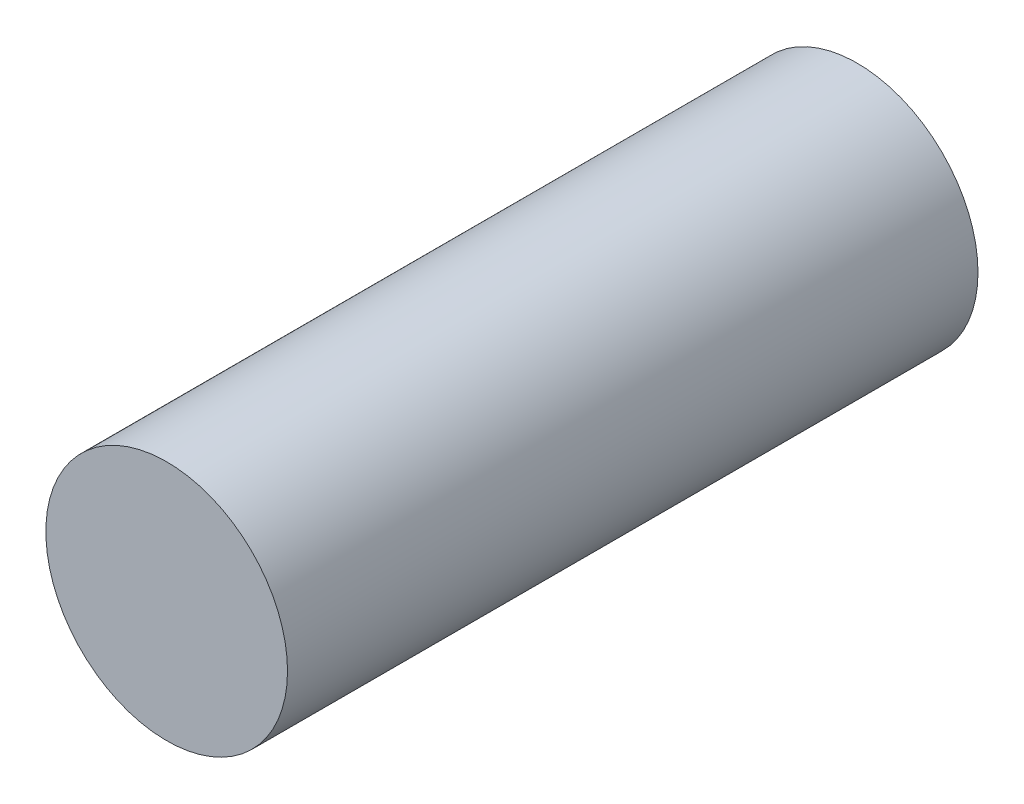
ISO-10303-21;
HEADER;
FILE_DESCRIPTION(('STEP AP214'),'2;1');
FILE_NAME('part.step','',(''),(''),'','','');
FILE_SCHEMA(('AUTOMOTIVE_DESIGN { 1 0 10303 214 1 1 1 1 }'));
ENDSEC;
DATA;
#1=APPLICATION_CONTEXT('core data for automotive mechanical design processes');
#2=APPLICATION_PROTOCOL_DEFINITION('international standard','automotive_design',2000,#1);
#3=PRODUCT_CONTEXT('',#1,'mechanical');
#4=PRODUCT('Part','Part','',(#3));
#5=PRODUCT_RELATED_PRODUCT_CATEGORY('part','',(#4));
#6=PRODUCT_DEFINITION_FORMATION('','',#4);
#7=PRODUCT_DEFINITION_CONTEXT('part definition',#1,'design');
#8=PRODUCT_DEFINITION('design','',#6,#7);
#9=PRODUCT_DEFINITION_SHAPE('','',#8);
#10=(LENGTH_UNIT() NAMED_UNIT(*) SI_UNIT(.MILLI.,.METRE.));
#11=(NAMED_UNIT(*) PLANE_ANGLE_UNIT() SI_UNIT($,.RADIAN.));
#12=(NAMED_UNIT(*) SI_UNIT($,.STERADIAN.) SOLID_ANGLE_UNIT());
#13=UNCERTAINTY_MEASURE_WITH_UNIT(LENGTH_MEASURE(1.E-05),#10,'distance_accuracy_value','');
#14=(GEOMETRIC_REPRESENTATION_CONTEXT(3) GLOBAL_UNCERTAINTY_ASSIGNED_CONTEXT((#13)) GLOBAL_UNIT_ASSIGNED_CONTEXT((#10,
#11,#12)) REPRESENTATION_CONTEXT('',''));
#15=CARTESIAN_POINT('',(0.,0.,0.));
#16=DIRECTION('',(0.,0.,1.));
#17=DIRECTION('',(1.,0.,0.));
#18=AXIS2_PLACEMENT_3D('',#15,#16,#17);
#19=CARTESIAN_POINT('',(0.,0.,100.));
#20=DIRECTION('',(0.,0.,-1.));
#21=DIRECTION('',(-1.,0.,0.));
#22=AXIS2_PLACEMENT_3D('',#19,#20,#21);
#23=CYLINDRICAL_SURFACE('',#22,17.5);
#24=CARTESIAN_POINT('',(0.,0.,100.));
#25=DIRECTION('',(0.,0.,1.));
#26=DIRECTION('',(1.,0.,0.));
#27=AXIS2_PLACEMENT_3D('',#24,#25,#26);
#28=CIRCLE('',#27,17.5);
#29=CARTESIAN_POINT('',(17.5,0.,100.));
#30=VERTEX_POINT('',#29);
#31=EDGE_CURVE('E10',#30,#30,#28,.T.);
#32=ORIENTED_EDGE('',*,*,#31,.F.);
#33=EDGE_LOOP('',(#32));
#34=FACE_BOUND('',#33,.T.);
#35=CARTESIAN_POINT('',(0.,0.,0.));
#36=DIRECTION('',(0.,0.,1.));
#37=DIRECTION('',(1.,0.,0.));
#38=AXIS2_PLACEMENT_3D('',#35,#36,#37);
#39=CIRCLE('',#38,17.5);
#40=CARTESIAN_POINT('',(17.5,0.,0.));
#41=VERTEX_POINT('',#40);
#42=EDGE_CURVE('E34',#41,#41,#39,.T.);
#43=ORIENTED_EDGE('',*,*,#42,.T.);
#44=EDGE_LOOP('',(#43));
#45=FACE_BOUND('',#44,.T.);
#46=ADVANCED_FACE('F31',(#34,#45),#23,.T.);
#47=CARTESIAN_POINT('',(0.,0.,100.));
#48=DIRECTION('',(0.,0.,1.));
#49=DIRECTION('',(1.,0.,0.));
#50=AXIS2_PLACEMENT_3D('',#47,#48,#49);
#51=PLANE('',#50);
#52=ORIENTED_EDGE('',*,*,#31,.T.);
#53=EDGE_LOOP('',(#52));
#54=FACE_BOUND('',#53,.T.);
#55=ADVANCED_FACE('F46',(#54),#51,.T.);
#56=CARTESIAN_POINT('',(0.,0.,0.));
#57=DIRECTION('',(0.,0.,1.));
#58=DIRECTION('',(1.,0.,0.));
#59=AXIS2_PLACEMENT_3D('',#56,#57,#58);
#60=PLANE('',#59);
#61=ORIENTED_EDGE('',*,*,#42,.F.);
#62=EDGE_LOOP('',(#61));
#63=FACE_BOUND('',#62,.T.);
#64=ADVANCED_FACE('F44',(#63),#60,.F.);
#65=CLOSED_SHELL('',(#46,#55,#64));
#66=MANIFOLD_SOLID_BREP('B2',#65);
#67=ADVANCED_BREP_SHAPE_REPRESENTATION('',(#18,#66),#14);
#68=SHAPE_DEFINITION_REPRESENTATION(#9,#67);
ENDSEC;
END-ISO-10303-21;
